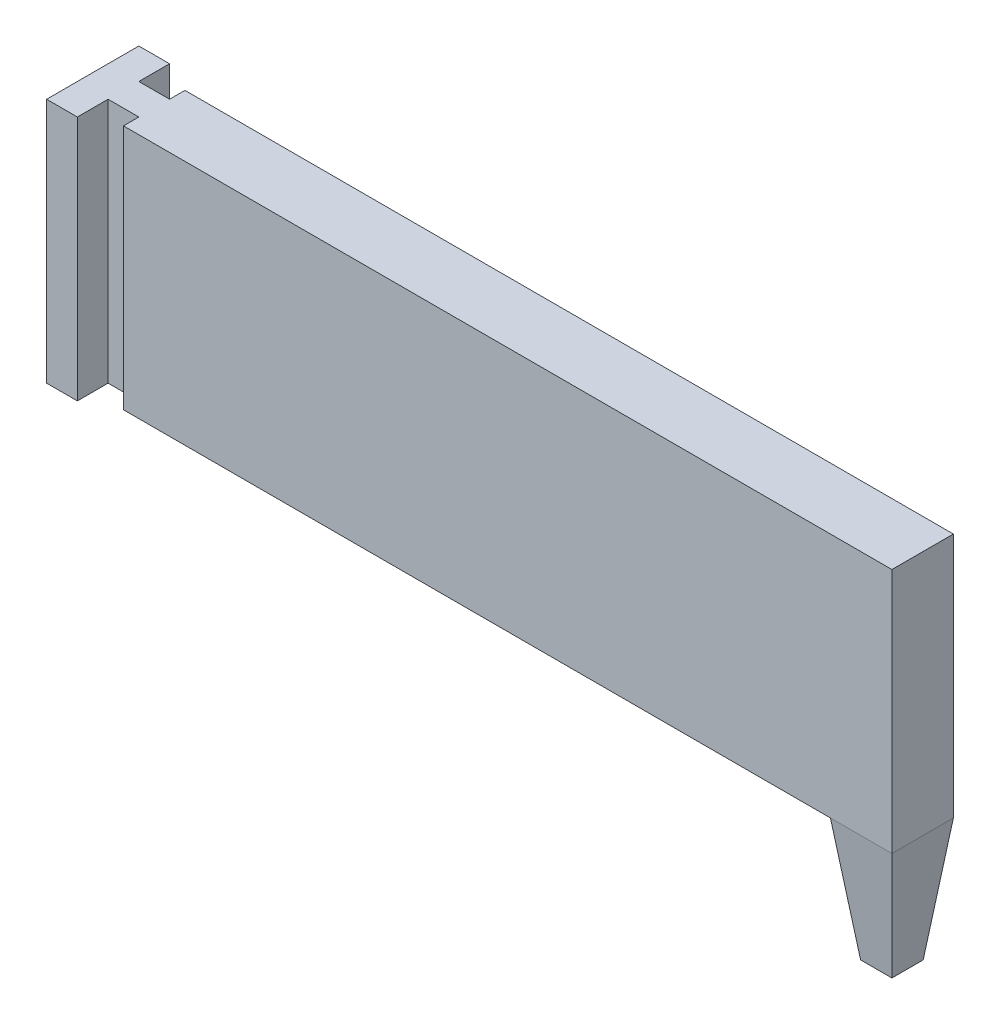
ISO-10303-21;
HEADER;
FILE_DESCRIPTION(('STEP AP214'),'2;1');
FILE_NAME('part.step','',(''),(''),'','','');
FILE_SCHEMA(('AUTOMOTIVE_DESIGN { 1 0 10303 214 1 1 1 1 }'));
ENDSEC;
DATA;
#1=APPLICATION_CONTEXT('core data for automotive mechanical design processes');
#2=APPLICATION_PROTOCOL_DEFINITION('international standard','automotive_design',2000,#1);
#3=PRODUCT_CONTEXT('',#1,'mechanical');
#4=PRODUCT('Part','Part','',(#3));
#5=PRODUCT_RELATED_PRODUCT_CATEGORY('part','',(#4));
#6=PRODUCT_DEFINITION_FORMATION('','',#4);
#7=PRODUCT_DEFINITION_CONTEXT('part definition',#1,'design');
#8=PRODUCT_DEFINITION('design','',#6,#7);
#9=PRODUCT_DEFINITION_SHAPE('','',#8);
#10=(LENGTH_UNIT() NAMED_UNIT(*) SI_UNIT(.MILLI.,.METRE.));
#11=(NAMED_UNIT(*) PLANE_ANGLE_UNIT() SI_UNIT($,.RADIAN.));
#12=(NAMED_UNIT(*) SI_UNIT($,.STERADIAN.) SOLID_ANGLE_UNIT());
#13=UNCERTAINTY_MEASURE_WITH_UNIT(LENGTH_MEASURE(1.E-05),#10,'distance_accuracy_value','');
#14=(GEOMETRIC_REPRESENTATION_CONTEXT(3) GLOBAL_UNCERTAINTY_ASSIGNED_CONTEXT((#13)) GLOBAL_UNIT_ASSIGNED_CONTEXT((#10,
#11,#12)) REPRESENTATION_CONTEXT('',''));
#15=CARTESIAN_POINT('',(0.,0.,0.));
#16=DIRECTION('',(0.,0.,1.));
#17=DIRECTION('',(1.,0.,0.));
#18=AXIS2_PLACEMENT_3D('',#15,#16,#17);
#19=CARTESIAN_POINT('',(0.,0.,0.));
#20=DIRECTION('',(0.,1.,0.));
#21=DIRECTION('',(0.,0.,1.));
#22=AXIS2_PLACEMENT_3D('',#19,#20,#21);
#23=PLANE('',#22);
#24=DIRECTION('',(0.,0.,-1.));
#25=VECTOR('',#24,1.);
#26=CARTESIAN_POINT('',(115.,0.,-5.00000000000001));
#27=LINE('',#26,#25);
#28=CARTESIAN_POINT('',(115.,0.,5.));
#29=VERTEX_POINT('',#28);
#30=CARTESIAN_POINT('',(115.,0.,-5.00000000000001));
#31=VERTEX_POINT('',#30);
#32=EDGE_CURVE('E61',#29,#31,#27,.T.);
#33=ORIENTED_EDGE('',*,*,#32,.F.);
#34=DIRECTION('',(1.,0.,0.));
#35=VECTOR('',#34,1.);
#36=CARTESIAN_POINT('',(0.,0.,5.));
#37=LINE('',#36,#35);
#38=CARTESIAN_POINT('',(0.,0.,5.));
#39=VERTEX_POINT('',#38);
#40=EDGE_CURVE('E435',#39,#29,#37,.T.);
#41=ORIENTED_EDGE('',*,*,#40,.F.);
#42=DIRECTION('',(0.,0.,1.));
#43=VECTOR('',#42,1.);
#44=CARTESIAN_POINT('',(0.,0.,-5.));
#45=LINE('',#44,#43);
#46=CARTESIAN_POINT('',(0.,0.,2.5));
#47=VERTEX_POINT('',#46);
#48=EDGE_CURVE('E175',#47,#39,#45,.T.);
#49=ORIENTED_EDGE('',*,*,#48,.F.);
#50=DIRECTION('',(1.,0.,0.));
#51=VECTOR('',#50,1.);
#52=CARTESIAN_POINT('',(-5.,0.,2.5));
#53=LINE('',#52,#51);
#54=CARTESIAN_POINT('',(-5.,0.,2.5));
#55=VERTEX_POINT('',#54);
#56=EDGE_CURVE('E200',#55,#47,#53,.T.);
#57=ORIENTED_EDGE('',*,*,#56,.F.);
#58=DIRECTION('',(0.,0.,-1.));
#59=VECTOR('',#58,1.);
#60=CARTESIAN_POINT('',(-5.00000000000001,0.,7.5));
#61=LINE('',#60,#59);
#62=CARTESIAN_POINT('',(-5.00000000000001,0.,7.5));
#63=VERTEX_POINT('',#62);
#64=EDGE_CURVE('E197',#63,#55,#61,.T.);
#65=ORIENTED_EDGE('',*,*,#64,.F.);
#66=DIRECTION('',(1.,0.,0.));
#67=VECTOR('',#66,1.);
#68=CARTESIAN_POINT('',(-10.,0.,7.5));
#69=LINE('',#68,#67);
#70=CARTESIAN_POINT('',(-10.,0.,7.5));
#71=VERTEX_POINT('',#70);
#72=EDGE_CURVE('E194',#71,#63,#69,.T.);
#73=ORIENTED_EDGE('',*,*,#72,.F.);
#74=DIRECTION('',(0.,0.,1.));
#75=VECTOR('',#74,1.);
#76=CARTESIAN_POINT('',(-10.,0.,-7.5));
#77=LINE('',#76,#75);
#78=CARTESIAN_POINT('',(-10.,0.,-7.5));
#79=VERTEX_POINT('',#78);
#80=EDGE_CURVE('E159',#79,#71,#77,.T.);
#81=ORIENTED_EDGE('',*,*,#80,.F.);
#82=DIRECTION('',(-1.,0.,0.));
#83=VECTOR('',#82,1.);
#84=CARTESIAN_POINT('',(-5.00000000000001,0.,-7.5));
#85=LINE('',#84,#83);
#86=CARTESIAN_POINT('',(-5.00000000000001,0.,-7.5));
#87=VERTEX_POINT('',#86);
#88=EDGE_CURVE('E153',#87,#79,#85,.T.);
#89=ORIENTED_EDGE('',*,*,#88,.F.);
#90=DIRECTION('',(0.,0.,-1.));
#91=VECTOR('',#90,1.);
#92=CARTESIAN_POINT('',(-5.,0.,-2.5));
#93=LINE('',#92,#91);
#94=CARTESIAN_POINT('',(-5.,0.,-2.5));
#95=VERTEX_POINT('',#94);
#96=EDGE_CURVE('E100',#95,#87,#93,.T.);
#97=ORIENTED_EDGE('',*,*,#96,.F.);
#98=DIRECTION('',(-1.,0.,0.));
#99=VECTOR('',#98,1.);
#100=CARTESIAN_POINT('',(0.,0.,-2.5));
#101=LINE('',#100,#99);
#102=CARTESIAN_POINT('',(0.,0.,-2.5));
#103=VERTEX_POINT('',#102);
#104=EDGE_CURVE('E204',#103,#95,#101,.T.);
#105=ORIENTED_EDGE('',*,*,#104,.F.);
#106=CARTESIAN_POINT('',(0.,0.,-5.));
#107=VERTEX_POINT('',#106);
#108=EDGE_CURVE('E143',#107,#103,#45,.T.);
#109=ORIENTED_EDGE('',*,*,#108,.F.);
#110=DIRECTION('',(1.,0.,0.));
#111=VECTOR('',#110,1.);
#112=CARTESIAN_POINT('',(0.,0.,-5.));
#113=LINE('',#112,#111);
#114=EDGE_CURVE('E468',#107,#31,#113,.T.);
#115=ORIENTED_EDGE('',*,*,#114,.T.);
#116=EDGE_LOOP('',(#33,#41,#49,#57,#65,#73,#81,#89,#97,#105,#109,#115));
#117=FACE_BOUND('',#116,.T.);
#118=ADVANCED_FACE('F45',(#117),#23,.F.);
#119=CARTESIAN_POINT('',(-5.00000000000001,40.,-7.5));
#120=DIRECTION('',(0.,0.,1.));
#121=DIRECTION('',(1.,0.,0.));
#122=AXIS2_PLACEMENT_3D('',#119,#120,#121);
#123=PLANE('',#122);
#124=ORIENTED_EDGE('',*,*,#88,.T.);
#125=DIRECTION('',(0.,-1.,0.));
#126=VECTOR('',#125,1.);
#127=CARTESIAN_POINT('',(-10.,40.,-7.5));
#128=LINE('',#127,#126);
#129=CARTESIAN_POINT('',(-10.,40.,-7.5));
#130=VERTEX_POINT('',#129);
#131=EDGE_CURVE('E11',#130,#79,#128,.T.);
#132=ORIENTED_EDGE('',*,*,#131,.F.);
#133=DIRECTION('',(-1.,0.,0.));
#134=VECTOR('',#133,1.);
#135=CARTESIAN_POINT('',(-5.00000000000001,40.,-7.5));
#136=LINE('',#135,#134);
#137=CARTESIAN_POINT('',(-5.00000000000001,40.,-7.5));
#138=VERTEX_POINT('',#137);
#139=EDGE_CURVE('E176',#138,#130,#136,.T.);
#140=ORIENTED_EDGE('',*,*,#139,.F.);
#141=DIRECTION('',(0.,-1.,0.));
#142=VECTOR('',#141,1.);
#143=CARTESIAN_POINT('',(-5.00000000000001,40.,-7.5));
#144=LINE('',#143,#142);
#145=EDGE_CURVE('E190',#138,#87,#144,.T.);
#146=ORIENTED_EDGE('',*,*,#145,.T.);
#147=EDGE_LOOP('',(#124,#132,#140,#146));
#148=FACE_BOUND('',#147,.T.);
#149=ADVANCED_FACE('F47',(#148),#123,.F.);
#150=CARTESIAN_POINT('',(-10.,40.,-7.5));
#151=DIRECTION('',(1.,0.,0.));
#152=DIRECTION('',(0.,0.,-1.));
#153=AXIS2_PLACEMENT_3D('',#150,#151,#152);
#154=PLANE('',#153);
#155=ORIENTED_EDGE('',*,*,#80,.T.);
#156=DIRECTION('',(0.,-1.,0.));
#157=VECTOR('',#156,1.);
#158=CARTESIAN_POINT('',(-10.,40.,7.5));
#159=LINE('',#158,#157);
#160=CARTESIAN_POINT('',(-10.,40.,7.5));
#161=VERTEX_POINT('',#160);
#162=EDGE_CURVE('E54',#161,#71,#159,.T.);
#163=ORIENTED_EDGE('',*,*,#162,.F.);
#164=DIRECTION('',(0.,0.,1.));
#165=VECTOR('',#164,1.);
#166=CARTESIAN_POINT('',(-10.,40.,-7.5));
#167=LINE('',#166,#165);
#168=EDGE_CURVE('E108',#130,#161,#167,.T.);
#169=ORIENTED_EDGE('',*,*,#168,.F.);
#170=ORIENTED_EDGE('',*,*,#131,.T.);
#171=EDGE_LOOP('',(#155,#163,#169,#170));
#172=FACE_BOUND('',#171,.T.);
#173=ADVANCED_FACE('F249',(#172),#154,.F.);
#174=CARTESIAN_POINT('',(-10.,40.,7.5));
#175=DIRECTION('',(0.,0.,-1.));
#176=DIRECTION('',(-1.,0.,0.));
#177=AXIS2_PLACEMENT_3D('',#174,#175,#176);
#178=PLANE('',#177);
#179=ORIENTED_EDGE('',*,*,#72,.T.);
#180=DIRECTION('',(0.,-1.,0.));
#181=VECTOR('',#180,1.);
#182=CARTESIAN_POINT('',(-5.00000000000001,40.,7.5));
#183=LINE('',#182,#181);
#184=CARTESIAN_POINT('',(-5.00000000000001,40.,7.5));
#185=VERTEX_POINT('',#184);
#186=EDGE_CURVE('E220',#185,#63,#183,.T.);
#187=ORIENTED_EDGE('',*,*,#186,.F.);
#188=DIRECTION('',(1.,0.,0.));
#189=VECTOR('',#188,1.);
#190=CARTESIAN_POINT('',(-10.,40.,7.5));
#191=LINE('',#190,#189);
#192=EDGE_CURVE('E181',#161,#185,#191,.T.);
#193=ORIENTED_EDGE('',*,*,#192,.F.);
#194=ORIENTED_EDGE('',*,*,#162,.T.);
#195=EDGE_LOOP('',(#179,#187,#193,#194));
#196=FACE_BOUND('',#195,.T.);
#197=ADVANCED_FACE('F228',(#196),#178,.F.);
#198=CARTESIAN_POINT('',(-5.00000000000001,40.,7.5));
#199=DIRECTION('',(-1.,0.,0.));
#200=DIRECTION('',(0.,0.,1.));
#201=AXIS2_PLACEMENT_3D('',#198,#199,#200);
#202=PLANE('',#201);
#203=ORIENTED_EDGE('',*,*,#64,.T.);
#204=DIRECTION('',(0.,-1.,0.));
#205=VECTOR('',#204,1.);
#206=CARTESIAN_POINT('',(-5.,40.,2.5));
#207=LINE('',#206,#205);
#208=CARTESIAN_POINT('',(-5.,40.,2.5));
#209=VERTEX_POINT('',#208);
#210=EDGE_CURVE('E216',#209,#55,#207,.T.);
#211=ORIENTED_EDGE('',*,*,#210,.F.);
#212=DIRECTION('',(0.,0.,-1.));
#213=VECTOR('',#212,1.);
#214=CARTESIAN_POINT('',(-5.00000000000001,40.,7.5));
#215=LINE('',#214,#213);
#216=EDGE_CURVE('E184',#185,#209,#215,.T.);
#217=ORIENTED_EDGE('',*,*,#216,.F.);
#218=ORIENTED_EDGE('',*,*,#186,.T.);
#219=EDGE_LOOP('',(#203,#211,#217,#218));
#220=FACE_BOUND('',#219,.T.);
#221=ADVANCED_FACE('F236',(#220),#202,.F.);
#222=CARTESIAN_POINT('',(-5.,40.,2.5));
#223=DIRECTION('',(0.,0.,-1.));
#224=DIRECTION('',(-1.,0.,0.));
#225=AXIS2_PLACEMENT_3D('',#222,#223,#224);
#226=PLANE('',#225);
#227=ORIENTED_EDGE('',*,*,#56,.T.);
#228=DIRECTION('',(0.,-1.,0.));
#229=VECTOR('',#228,1.);
#230=CARTESIAN_POINT('',(0.,40.,2.5));
#231=LINE('',#230,#229);
#232=CARTESIAN_POINT('',(0.,40.,2.5));
#233=VERTEX_POINT('',#232);
#234=EDGE_CURVE('E145',#233,#47,#231,.T.);
#235=ORIENTED_EDGE('',*,*,#234,.F.);
#236=DIRECTION('',(1.,0.,0.));
#237=VECTOR('',#236,1.);
#238=CARTESIAN_POINT('',(-5.,40.,2.5));
#239=LINE('',#238,#237);
#240=EDGE_CURVE('E132',#209,#233,#239,.T.);
#241=ORIENTED_EDGE('',*,*,#240,.F.);
#242=ORIENTED_EDGE('',*,*,#210,.T.);
#243=EDGE_LOOP('',(#227,#235,#241,#242));
#244=FACE_BOUND('',#243,.T.);
#245=ADVANCED_FACE('F240',(#244),#226,.F.);
#246=CARTESIAN_POINT('',(0.,40.,-2.5));
#247=DIRECTION('',(0.,0.,1.));
#248=DIRECTION('',(1.,0.,0.));
#249=AXIS2_PLACEMENT_3D('',#246,#247,#248);
#250=PLANE('',#249);
#251=ORIENTED_EDGE('',*,*,#104,.T.);
#252=DIRECTION('',(0.,-1.,0.));
#253=VECTOR('',#252,1.);
#254=CARTESIAN_POINT('',(-5.,40.,-2.5));
#255=LINE('',#254,#253);
#256=CARTESIAN_POINT('',(-5.,40.,-2.5));
#257=VERTEX_POINT('',#256);
#258=EDGE_CURVE('E129',#257,#95,#255,.T.);
#259=ORIENTED_EDGE('',*,*,#258,.F.);
#260=DIRECTION('',(-1.,0.,0.));
#261=VECTOR('',#260,1.);
#262=CARTESIAN_POINT('',(0.,40.,-2.5));
#263=LINE('',#262,#261);
#264=CARTESIAN_POINT('',(0.,40.,-2.5));
#265=VERTEX_POINT('',#264);
#266=EDGE_CURVE('E124',#265,#257,#263,.T.);
#267=ORIENTED_EDGE('',*,*,#266,.F.);
#268=DIRECTION('',(0.,-1.,0.));
#269=VECTOR('',#268,1.);
#270=CARTESIAN_POINT('',(0.,40.,-2.5));
#271=LINE('',#270,#269);
#272=EDGE_CURVE('E127',#265,#103,#271,.T.);
#273=ORIENTED_EDGE('',*,*,#272,.T.);
#274=EDGE_LOOP('',(#251,#259,#267,#273));
#275=FACE_BOUND('',#274,.T.);
#276=ADVANCED_FACE('F126',(#275),#250,.F.);
#277=CARTESIAN_POINT('',(-5.,40.,-2.5));
#278=DIRECTION('',(-1.,0.,0.));
#279=DIRECTION('',(0.,0.,1.));
#280=AXIS2_PLACEMENT_3D('',#277,#278,#279);
#281=PLANE('',#280);
#282=ORIENTED_EDGE('',*,*,#96,.T.);
#283=ORIENTED_EDGE('',*,*,#145,.F.);
#284=DIRECTION('',(0.,0.,-1.));
#285=VECTOR('',#284,1.);
#286=CARTESIAN_POINT('',(-5.,40.,-2.5));
#287=LINE('',#286,#285);
#288=EDGE_CURVE('E70',#257,#138,#287,.T.);
#289=ORIENTED_EDGE('',*,*,#288,.F.);
#290=ORIENTED_EDGE('',*,*,#258,.T.);
#291=EDGE_LOOP('',(#282,#283,#289,#290));
#292=FACE_BOUND('',#291,.T.);
#293=ADVANCED_FACE('F265',(#292),#281,.F.);
#294=CARTESIAN_POINT('',(0.,40.,0.));
#295=DIRECTION('',(0.,1.,0.));
#296=DIRECTION('',(0.,0.,1.));
#297=AXIS2_PLACEMENT_3D('',#294,#295,#296);
#298=PLANE('',#297);
#299=ORIENTED_EDGE('',*,*,#139,.T.);
#300=ORIENTED_EDGE('',*,*,#168,.T.);
#301=ORIENTED_EDGE('',*,*,#192,.T.);
#302=ORIENTED_EDGE('',*,*,#216,.T.);
#303=ORIENTED_EDGE('',*,*,#240,.T.);
#304=DIRECTION('',(0.,0.,1.));
#305=VECTOR('',#304,1.);
#306=CARTESIAN_POINT('',(0.,40.,-5.));
#307=LINE('',#306,#305);
#308=CARTESIAN_POINT('',(0.,40.,5.));
#309=VERTEX_POINT('',#308);
#310=EDGE_CURVE('E154',#233,#309,#307,.T.);
#311=ORIENTED_EDGE('',*,*,#310,.T.);
#312=DIRECTION('',(-1.,0.,0.));
#313=VECTOR('',#312,1.);
#314=CARTESIAN_POINT('',(125.,40.,5.));
#315=LINE('',#314,#313);
#316=CARTESIAN_POINT('',(125.,40.,5.));
#317=VERTEX_POINT('',#316);
#318=EDGE_CURVE('E462',#317,#309,#315,.T.);
#319=ORIENTED_EDGE('',*,*,#318,.F.);
#320=DIRECTION('',(0.,0.,1.));
#321=VECTOR('',#320,1.);
#322=CARTESIAN_POINT('',(125.,40.,-5.));
#323=LINE('',#322,#321);
#324=CARTESIAN_POINT('',(125.,40.,-5.));
#325=VERTEX_POINT('',#324);
#326=EDGE_CURVE('E162',#325,#317,#323,.T.);
#327=ORIENTED_EDGE('',*,*,#326,.F.);
#328=DIRECTION('',(-1.,0.,0.));
#329=VECTOR('',#328,1.);
#330=CARTESIAN_POINT('',(125.,40.,-5.));
#331=LINE('',#330,#329);
#332=CARTESIAN_POINT('',(0.,40.,-5.));
#333=VERTEX_POINT('',#332);
#334=EDGE_CURVE('E151',#325,#333,#331,.T.);
#335=ORIENTED_EDGE('',*,*,#334,.T.);
#336=EDGE_CURVE('E140',#333,#265,#307,.T.);
#337=ORIENTED_EDGE('',*,*,#336,.T.);
#338=ORIENTED_EDGE('',*,*,#266,.T.);
#339=ORIENTED_EDGE('',*,*,#288,.T.);
#340=EDGE_LOOP('',(#299,#300,#301,#302,#303,#311,#319,#327,#335,#337,#338,#339));
#341=FACE_BOUND('',#340,.T.);
#342=ADVANCED_FACE('F148',(#341),#298,.T.);
#343=CARTESIAN_POINT('',(0.,40.,-5.));
#344=DIRECTION('',(-1.,0.,0.));
#345=DIRECTION('',(0.,0.,1.));
#346=AXIS2_PLACEMENT_3D('',#343,#344,#345);
#347=PLANE('',#346);
#348=ORIENTED_EDGE('',*,*,#272,.F.);
#349=ORIENTED_EDGE('',*,*,#336,.F.);
#350=DIRECTION('',(0.,-1.,0.));
#351=VECTOR('',#350,1.);
#352=CARTESIAN_POINT('',(0.,40.,-5.));
#353=LINE('',#352,#351);
#354=EDGE_CURVE('E465',#333,#107,#353,.T.);
#355=ORIENTED_EDGE('',*,*,#354,.T.);
#356=ORIENTED_EDGE('',*,*,#108,.T.);
#357=EDGE_LOOP('',(#348,#349,#355,#356));
#358=FACE_BOUND('',#357,.T.);
#359=ADVANCED_FACE('F137',(#358),#347,.T.);
#360=ORIENTED_EDGE('',*,*,#310,.F.);
#361=ORIENTED_EDGE('',*,*,#234,.T.);
#362=ORIENTED_EDGE('',*,*,#48,.T.);
#363=DIRECTION('',(0.,-1.,0.));
#364=VECTOR('',#363,1.);
#365=CARTESIAN_POINT('',(0.,40.,5.));
#366=LINE('',#365,#364);
#367=EDGE_CURVE('E429',#309,#39,#366,.T.);
#368=ORIENTED_EDGE('',*,*,#367,.F.);
#369=EDGE_LOOP('',(#360,#361,#362,#368));
#370=FACE_BOUND('',#369,.T.);
#371=ADVANCED_FACE('F304',(#370),#347,.T.);
#372=CARTESIAN_POINT('',(125.,0.,-5.));
#373=DIRECTION('',(1.,0.,0.));
#374=DIRECTION('',(0.,0.,-1.));
#375=AXIS2_PLACEMENT_3D('',#372,#373,#374);
#376=PLANE('',#375);
#377=ORIENTED_EDGE('',*,*,#326,.T.);
#378=DIRECTION('',(0.,1.,0.));
#379=VECTOR('',#378,1.);
#380=CARTESIAN_POINT('',(125.,0.,5.));
#381=LINE('',#380,#379);
#382=CARTESIAN_POINT('',(125.,0.,5.));
#383=VERTEX_POINT('',#382);
#384=EDGE_CURVE('E458',#383,#317,#381,.T.);
#385=ORIENTED_EDGE('',*,*,#384,.F.);
#386=DIRECTION('',(0.,0.,1.));
#387=VECTOR('',#386,1.);
#388=CARTESIAN_POINT('',(125.,0.,-5.));
#389=LINE('',#388,#387);
#390=CARTESIAN_POINT('',(125.,0.,-5.));
#391=VERTEX_POINT('',#390);
#392=EDGE_CURVE('E169',#391,#383,#389,.T.);
#393=ORIENTED_EDGE('',*,*,#392,.F.);
#394=DIRECTION('',(0.,1.,0.));
#395=VECTOR('',#394,1.);
#396=CARTESIAN_POINT('',(125.,0.,-5.));
#397=LINE('',#396,#395);
#398=EDGE_CURVE('E470',#391,#325,#397,.T.);
#399=ORIENTED_EDGE('',*,*,#398,.T.);
#400=EDGE_LOOP('',(#377,#385,#393,#399));
#401=FACE_BOUND('',#400,.T.);
#402=ADVANCED_FACE('F310',(#401),#376,.T.);
#403=CARTESIAN_POINT('',(0.,0.,-5.));
#404=DIRECTION('',(0.,0.,1.));
#405=DIRECTION('',(1.,0.,0.));
#406=AXIS2_PLACEMENT_3D('',#403,#404,#405);
#407=PLANE('',#406);
#408=ORIENTED_EDGE('',*,*,#354,.F.);
#409=ORIENTED_EDGE('',*,*,#334,.F.);
#410=ORIENTED_EDGE('',*,*,#398,.F.);
#411=DIRECTION('',(1.,0.,0.));
#412=VECTOR('',#411,1.);
#413=CARTESIAN_POINT('',(125.,0.,-5.));
#414=LINE('',#413,#412);
#415=EDGE_CURVE('E421',#31,#391,#414,.T.);
#416=ORIENTED_EDGE('',*,*,#415,.F.);
#417=ORIENTED_EDGE('',*,*,#114,.F.);
#418=EDGE_LOOP('',(#408,#409,#410,#416,#417));
#419=FACE_BOUND('',#418,.T.);
#420=ADVANCED_FACE('F321',(#419),#407,.F.);
#421=CARTESIAN_POINT('',(0.,0.,5.));
#422=DIRECTION('',(0.,0.,1.));
#423=DIRECTION('',(1.,0.,0.));
#424=AXIS2_PLACEMENT_3D('',#421,#422,#423);
#425=PLANE('',#424);
#426=ORIENTED_EDGE('',*,*,#367,.T.);
#427=ORIENTED_EDGE('',*,*,#40,.T.);
#428=DIRECTION('',(-1.,0.,0.));
#429=VECTOR('',#428,1.);
#430=CARTESIAN_POINT('',(125.,0.,5.));
#431=LINE('',#430,#429);
#432=EDGE_CURVE('E498',#383,#29,#431,.T.);
#433=ORIENTED_EDGE('',*,*,#432,.F.);
#434=ORIENTED_EDGE('',*,*,#384,.T.);
#435=ORIENTED_EDGE('',*,*,#318,.T.);
#436=EDGE_LOOP('',(#426,#427,#433,#434,#435));
#437=FACE_BOUND('',#436,.T.);
#438=ADVANCED_FACE('F331',(#437),#425,.T.);
#439=CARTESIAN_POINT('',(125.,0.,-5.));
#440=DIRECTION('',(0.992546151641322,-0.121869343405148,0.));
#441=DIRECTION('',(0.121869343405148,0.992546151641322,0.));
#442=AXIS2_PLACEMENT_3D('',#439,#440,#441);
#443=PLANE('',#442);
#444=ORIENTED_EDGE('',*,*,#392,.T.);
#445=DIRECTION('',(0.120974291151355,0.985256536015293,0.120974291151355));
#446=VECTOR('',#445,1.);
#447=CARTESIAN_POINT('',(125.,0.,5.));
#448=LINE('',#447,#446);
#449=CARTESIAN_POINT('',(122.544308781942,-20.,2.54430878194191));
#450=VERTEX_POINT('',#449);
#451=EDGE_CURVE('E424',#450,#383,#448,.T.);
#452=ORIENTED_EDGE('',*,*,#451,.F.);
#453=DIRECTION('',(0.,0.,-1.));
#454=VECTOR('',#453,1.);
#455=CARTESIAN_POINT('',(122.544308781942,-20.,-5.));
#456=LINE('',#455,#454);
#457=CARTESIAN_POINT('',(122.544308781942,-20.,-2.54430878194191));
#458=VERTEX_POINT('',#457);
#459=EDGE_CURVE('E406',#458,#450,#456,.F.);
#460=ORIENTED_EDGE('',*,*,#459,.F.);
#461=DIRECTION('',(0.120974291151355,0.985256536015293,-0.120974291151355));
#462=VECTOR('',#461,1.);
#463=CARTESIAN_POINT('',(125.,0.,-5.));
#464=LINE('',#463,#462);
#465=EDGE_CURVE('E443',#458,#391,#464,.T.);
#466=ORIENTED_EDGE('',*,*,#465,.T.);
#467=EDGE_LOOP('',(#444,#452,#460,#466));
#468=FACE_BOUND('',#467,.T.);
#469=ADVANCED_FACE('F341',(#468),#443,.T.);
#470=CARTESIAN_POINT('',(125.,0.,5.));
#471=DIRECTION('',(0.,-0.121869343405148,0.992546151641322));
#472=DIRECTION('',(0.,-0.992546151641322,-0.121869343405148));
#473=AXIS2_PLACEMENT_3D('',#470,#471,#472);
#474=PLANE('',#473);
#475=ORIENTED_EDGE('',*,*,#432,.T.);
#476=DIRECTION('',(-0.120974291151355,0.985256536015293,0.120974291151355));
#477=VECTOR('',#476,1.);
#478=CARTESIAN_POINT('',(115.146347791196,-1.19190711046689,4.85365220880427));
#479=LINE('',#478,#477);
#480=CARTESIAN_POINT('',(117.455691218058,-20.,2.54430878194191));
#481=VERTEX_POINT('',#480);
#482=EDGE_CURVE('E430',#481,#29,#479,.T.);
#483=ORIENTED_EDGE('',*,*,#482,.F.);
#484=DIRECTION('',(1.,0.,0.));
#485=VECTOR('',#484,1.);
#486=CARTESIAN_POINT('',(125.,-20.,2.54430878194191));
#487=LINE('',#486,#485);
#488=EDGE_CURVE('E411',#450,#481,#487,.F.);
#489=ORIENTED_EDGE('',*,*,#488,.F.);
#490=ORIENTED_EDGE('',*,*,#451,.T.);
#491=EDGE_LOOP('',(#475,#483,#489,#490));
#492=FACE_BOUND('',#491,.T.);
#493=ADVANCED_FACE('F358',(#492),#474,.T.);
#494=CARTESIAN_POINT('',(115.,0.,-5.00000000000001));
#495=DIRECTION('',(-0.992546151641322,-0.121869343405148,0.));
#496=DIRECTION('',(0.121869343405148,-0.992546151641322,0.));
#497=AXIS2_PLACEMENT_3D('',#494,#495,#496);
#498=PLANE('',#497);
#499=ORIENTED_EDGE('',*,*,#32,.T.);
#500=DIRECTION('',(-0.120974291151355,0.985256536015293,-0.120974291151355));
#501=VECTOR('',#500,1.);
#502=CARTESIAN_POINT('',(115.146347791196,-1.19190711046689,-4.85365220880428));
#503=LINE('',#502,#501);
#504=CARTESIAN_POINT('',(117.455691218058,-20.,-2.54430878194191));
#505=VERTEX_POINT('',#504);
#506=EDGE_CURVE('E438',#505,#31,#503,.T.);
#507=ORIENTED_EDGE('',*,*,#506,.F.);
#508=DIRECTION('',(0.,0.,1.));
#509=VECTOR('',#508,1.);
#510=CARTESIAN_POINT('',(117.455691218058,-20.,-5.00000000000001));
#511=LINE('',#510,#509);
#512=EDGE_CURVE('E451',#481,#505,#511,.F.);
#513=ORIENTED_EDGE('',*,*,#512,.F.);
#514=ORIENTED_EDGE('',*,*,#482,.T.);
#515=EDGE_LOOP('',(#499,#507,#513,#514));
#516=FACE_BOUND('',#515,.T.);
#517=ADVANCED_FACE('F368',(#516),#498,.T.);
#518=CARTESIAN_POINT('',(125.,0.,-5.));
#519=DIRECTION('',(0.,-0.121869343405148,-0.992546151641322));
#520=DIRECTION('',(0.,0.992546151641322,-0.121869343405148));
#521=AXIS2_PLACEMENT_3D('',#518,#519,#520);
#522=PLANE('',#521);
#523=ORIENTED_EDGE('',*,*,#415,.T.);
#524=ORIENTED_EDGE('',*,*,#465,.F.);
#525=DIRECTION('',(-1.,0.,0.));
#526=VECTOR('',#525,1.);
#527=CARTESIAN_POINT('',(125.,-20.,-2.54430878194191));
#528=LINE('',#527,#526);
#529=EDGE_CURVE('E415',#505,#458,#528,.F.);
#530=ORIENTED_EDGE('',*,*,#529,.F.);
#531=ORIENTED_EDGE('',*,*,#506,.T.);
#532=EDGE_LOOP('',(#523,#524,#530,#531));
#533=FACE_BOUND('',#532,.T.);
#534=ADVANCED_FACE('F378',(#533),#522,.T.);
#535=CARTESIAN_POINT('',(0.,-20.,0.));
#536=DIRECTION('',(0.,-1.,0.));
#537=DIRECTION('',(0.,0.,-1.));
#538=AXIS2_PLACEMENT_3D('',#535,#536,#537);
#539=PLANE('',#538);
#540=ORIENTED_EDGE('',*,*,#459,.T.);
#541=ORIENTED_EDGE('',*,*,#488,.T.);
#542=ORIENTED_EDGE('',*,*,#512,.T.);
#543=ORIENTED_EDGE('',*,*,#529,.T.);
#544=EDGE_LOOP('',(#540,#541,#542,#543));
#545=FACE_BOUND('',#544,.T.);
#546=ADVANCED_FACE('F388',(#545),#539,.T.);
#547=CLOSED_SHELL('',(#118,#149,#173,#197,#221,#245,#276,#293,#342,#359,#371,#402,#420,#438,
#469,#493,#517,#534,#546));
#548=MANIFOLD_SOLID_BREP('B2',#547);
#549=ADVANCED_BREP_SHAPE_REPRESENTATION('',(#18,#548),#14);
#550=SHAPE_DEFINITION_REPRESENTATION(#9,#549);
ENDSEC;
END-ISO-10303-21;
